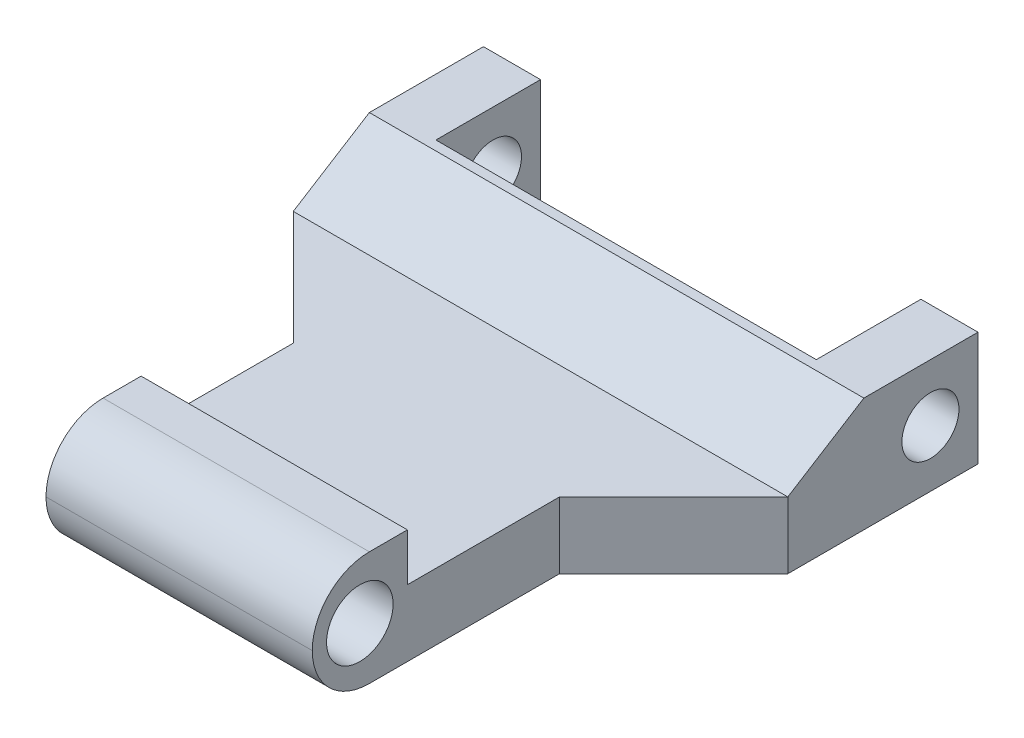
ISO-10303-21;
HEADER;
FILE_DESCRIPTION(('STEP AP214'),'2;1');
FILE_NAME('part.step','',(''),(''),'','','');
FILE_SCHEMA(('AUTOMOTIVE_DESIGN { 1 0 10303 214 1 1 1 1 }'));
ENDSEC;
DATA;
#1=APPLICATION_CONTEXT('core data for automotive mechanical design processes');
#2=APPLICATION_PROTOCOL_DEFINITION('international standard','automotive_design',2000,#1);
#3=PRODUCT_CONTEXT('',#1,'mechanical');
#4=PRODUCT('Part','Part','',(#3));
#5=PRODUCT_RELATED_PRODUCT_CATEGORY('part','',(#4));
#6=PRODUCT_DEFINITION_FORMATION('','',#4);
#7=PRODUCT_DEFINITION_CONTEXT('part definition',#1,'design');
#8=PRODUCT_DEFINITION('design','',#6,#7);
#9=PRODUCT_DEFINITION_SHAPE('','',#8);
#10=(LENGTH_UNIT() NAMED_UNIT(*) SI_UNIT(.MILLI.,.METRE.));
#11=(NAMED_UNIT(*) PLANE_ANGLE_UNIT() SI_UNIT($,.RADIAN.));
#12=(NAMED_UNIT(*) SI_UNIT($,.STERADIAN.) SOLID_ANGLE_UNIT());
#13=UNCERTAINTY_MEASURE_WITH_UNIT(LENGTH_MEASURE(1.E-05),#10,'distance_accuracy_value','');
#14=(GEOMETRIC_REPRESENTATION_CONTEXT(3) GLOBAL_UNCERTAINTY_ASSIGNED_CONTEXT((#13)) GLOBAL_UNIT_ASSIGNED_CONTEXT((#10,
#11,#12)) REPRESENTATION_CONTEXT('',''));
#15=CARTESIAN_POINT('',(0.,0.,0.));
#16=DIRECTION('',(0.,0.,1.));
#17=DIRECTION('',(1.,0.,0.));
#18=AXIS2_PLACEMENT_3D('',#15,#16,#17);
#19=CARTESIAN_POINT('',(-13.,6.,-18.7089552238806));
#20=DIRECTION('',(0.,0.,1.));
#21=DIRECTION('',(1.,0.,0.));
#22=AXIS2_PLACEMENT_3D('',#19,#20,#21);
#23=PLANE('',#22);
#24=DIRECTION('',(-1.,0.,0.));
#25=VECTOR('',#24,1.);
#26=CARTESIAN_POINT('',(-13.,0.,-18.7089552238806));
#27=LINE('',#26,#25);
#28=CARTESIAN_POINT('',(13.,0.,-18.7089552238806));
#29=VERTEX_POINT('',#28);
#30=CARTESIAN_POINT('',(10.,0.,-18.7089552238806));
#31=VERTEX_POINT('',#30);
#32=EDGE_CURVE('E170',#29,#31,#27,.T.);
#33=ORIENTED_EDGE('',*,*,#32,.T.);
#34=DIRECTION('',(0.,1.,0.));
#35=VECTOR('',#34,1.);
#36=CARTESIAN_POINT('',(10.,0.,-18.7089552238806));
#37=LINE('',#36,#35);
#38=CARTESIAN_POINT('',(10.,6.,-18.7089552238806));
#39=VERTEX_POINT('',#38);
#40=EDGE_CURVE('E220',#31,#39,#37,.T.);
#41=ORIENTED_EDGE('',*,*,#40,.T.);
#42=DIRECTION('',(-1.,0.,0.));
#43=VECTOR('',#42,1.);
#44=CARTESIAN_POINT('',(-13.,6.,-18.7089552238806));
#45=LINE('',#44,#43);
#46=CARTESIAN_POINT('',(13.,6.,-18.7089552238806));
#47=VERTEX_POINT('',#46);
#48=EDGE_CURVE('E271',#47,#39,#45,.T.);
#49=ORIENTED_EDGE('',*,*,#48,.F.);
#50=DIRECTION('',(0.,-1.,0.));
#51=VECTOR('',#50,1.);
#52=CARTESIAN_POINT('',(13.,6.,-18.7089552238806));
#53=LINE('',#52,#51);
#54=EDGE_CURVE('E190',#47,#29,#53,.T.);
#55=ORIENTED_EDGE('',*,*,#54,.T.);
#56=EDGE_LOOP('',(#33,#41,#49,#55));
#57=FACE_BOUND('',#56,.T.);
#58=ADVANCED_FACE('F32',(#57),#23,.F.);
#59=CARTESIAN_POINT('',(0.,6.,0.));
#60=DIRECTION('',(0.,-1.,0.));
#61=DIRECTION('',(0.,0.,-1.));
#62=AXIS2_PLACEMENT_3D('',#59,#60,#61);
#63=PLANE('',#62);
#64=DIRECTION('',(0.,0.,1.));
#65=VECTOR('',#64,1.);
#66=CARTESIAN_POINT('',(-7.,6.,10.2910447761194));
#67=LINE('',#66,#65);
#68=CARTESIAN_POINT('',(-7.,6.,5.2910447761194));
#69=VERTEX_POINT('',#68);
#70=CARTESIAN_POINT('',(-7.,6.,7.2910447761194));
#71=VERTEX_POINT('',#70);
#72=EDGE_CURVE('E182',#69,#71,#67,.T.);
#73=ORIENTED_EDGE('',*,*,#72,.T.);
#74=DIRECTION('',(1.,0.,0.));
#75=VECTOR('',#74,1.);
#76=CARTESIAN_POINT('',(0.,6.,7.2910447761194));
#77=LINE('',#76,#75);
#78=CARTESIAN_POINT('',(7.,6.,7.2910447761194));
#79=VERTEX_POINT('',#78);
#80=EDGE_CURVE('E11',#71,#79,#77,.T.);
#81=ORIENTED_EDGE('',*,*,#80,.T.);
#82=DIRECTION('',(0.,0.,-1.));
#83=VECTOR('',#82,1.);
#84=CARTESIAN_POINT('',(7.,6.,10.2910447761194));
#85=LINE('',#84,#83);
#86=CARTESIAN_POINT('',(7.,6.,5.2910447761194));
#87=VERTEX_POINT('',#86);
#88=EDGE_CURVE('E267',#79,#87,#85,.T.);
#89=ORIENTED_EDGE('',*,*,#88,.T.);
#90=DIRECTION('',(-1.,0.,0.));
#91=VECTOR('',#90,1.);
#92=CARTESIAN_POINT('',(0.,6.,5.2910447761194));
#93=LINE('',#92,#91);
#94=EDGE_CURVE('E198',#87,#69,#93,.T.);
#95=ORIENTED_EDGE('',*,*,#94,.T.);
#96=EDGE_LOOP('',(#73,#81,#89,#95));
#97=FACE_BOUND('',#96,.T.);
#98=ADVANCED_FACE('F320',(#97),#63,.F.);
#99=CARTESIAN_POINT('',(-7.,6.,10.2910447761194));
#100=DIRECTION('',(1.,0.,0.));
#101=DIRECTION('',(0.,0.,-1.));
#102=AXIS2_PLACEMENT_3D('',#99,#100,#101);
#103=PLANE('',#102);
#104=CARTESIAN_POINT('',(-7.,3.,7.79104477611941));
#105=DIRECTION('',(-1.,0.,0.));
#106=DIRECTION('',(0.,0.,1.));
#107=AXIS2_PLACEMENT_3D('',#104,#105,#106);
#108=CIRCLE('',#107,1.75);
#109=CARTESIAN_POINT('',(-7.,3.,9.5410447761194));
#110=VERTEX_POINT('',#109);
#111=EDGE_CURVE('E209',#110,#110,#108,.T.);
#112=ORIENTED_EDGE('',*,*,#111,.F.);
#113=EDGE_LOOP('',(#112));
#114=FACE_BOUND('',#113,.T.);
#115=DIRECTION('',(0.,0.,1.));
#116=VECTOR('',#115,1.);
#117=CARTESIAN_POINT('',(-7.,0.,10.2910447761194));
#118=LINE('',#117,#116);
#119=CARTESIAN_POINT('',(-7.,0.,-2.7089552238806));
#120=VERTEX_POINT('',#119);
#121=CARTESIAN_POINT('',(-7.,0.,7.2910447761194));
#122=VERTEX_POINT('',#121);
#123=EDGE_CURVE('E264',#120,#122,#118,.T.);
#124=ORIENTED_EDGE('',*,*,#123,.T.);
#125=CARTESIAN_POINT('',(-7.,3.,7.2910447761194));
#126=DIRECTION('',(1.,0.,0.));
#127=DIRECTION('',(0.,0.,-1.));
#128=AXIS2_PLACEMENT_3D('',#125,#126,#127);
#129=CIRCLE('',#128,3.);
#130=CARTESIAN_POINT('',(-7.,3.,10.2910447761194));
#131=VERTEX_POINT('',#130);
#132=EDGE_CURVE('E41',#122,#131,#129,.F.);
#133=ORIENTED_EDGE('',*,*,#132,.T.);
#134=CARTESIAN_POINT('',(-7.,3.,7.2910447761194));
#135=DIRECTION('',(1.,0.,0.));
#136=DIRECTION('',(0.,0.,-1.));
#137=AXIS2_PLACEMENT_3D('',#134,#135,#136);
#138=CIRCLE('',#137,3.);
#139=EDGE_CURVE('E216',#131,#71,#138,.F.);
#140=ORIENTED_EDGE('',*,*,#139,.T.);
#141=ORIENTED_EDGE('',*,*,#72,.F.);
#142=DIRECTION('',(0.,-1.,0.));
#143=VECTOR('',#142,1.);
#144=CARTESIAN_POINT('',(-7.,6.,5.2910447761194));
#145=LINE('',#144,#143);
#146=CARTESIAN_POINT('',(-7.,3.5,5.2910447761194));
#147=VERTEX_POINT('',#146);
#148=EDGE_CURVE('E252',#69,#147,#145,.T.);
#149=ORIENTED_EDGE('',*,*,#148,.T.);
#150=DIRECTION('',(0.,0.,-1.));
#151=VECTOR('',#150,1.);
#152=CARTESIAN_POINT('',(-7.,3.5,10.2910447761194));
#153=LINE('',#152,#151);
#154=CARTESIAN_POINT('',(-7.,3.5,-2.7089552238806));
#155=VERTEX_POINT('',#154);
#156=EDGE_CURVE('E255',#147,#155,#153,.T.);
#157=ORIENTED_EDGE('',*,*,#156,.T.);
#158=DIRECTION('',(0.,-1.,0.));
#159=VECTOR('',#158,1.);
#160=CARTESIAN_POINT('',(-7.,6.,-2.7089552238806));
#161=LINE('',#160,#159);
#162=EDGE_CURVE('E183',#155,#120,#161,.T.);
#163=ORIENTED_EDGE('',*,*,#162,.T.);
#164=EDGE_LOOP('',(#124,#133,#140,#141,#149,#157,#163));
#165=FACE_BOUND('',#164,.T.);
#166=ADVANCED_FACE('F325',(#114,#165),#103,.F.);
#167=CARTESIAN_POINT('',(7.,6.,10.2910447761194));
#168=DIRECTION('',(-1.,0.,0.));
#169=DIRECTION('',(0.,0.,1.));
#170=AXIS2_PLACEMENT_3D('',#167,#168,#169);
#171=PLANE('',#170);
#172=CARTESIAN_POINT('',(7.,3.,7.79104477611941));
#173=DIRECTION('',(-1.,0.,0.));
#174=DIRECTION('',(0.,0.,1.));
#175=AXIS2_PLACEMENT_3D('',#172,#173,#174);
#176=CIRCLE('',#175,1.75);
#177=CARTESIAN_POINT('',(7.,3.,9.5410447761194));
#178=VERTEX_POINT('',#177);
#179=EDGE_CURVE('E205',#178,#178,#176,.T.);
#180=ORIENTED_EDGE('',*,*,#179,.T.);
#181=EDGE_LOOP('',(#180));
#182=FACE_BOUND('',#181,.T.);
#183=CARTESIAN_POINT('',(7.,3.,7.2910447761194));
#184=DIRECTION('',(-1.,0.,0.));
#185=DIRECTION('',(0.,0.,1.));
#186=AXIS2_PLACEMENT_3D('',#183,#184,#185);
#187=CIRCLE('',#186,3.);
#188=CARTESIAN_POINT('',(7.,3.,10.2910447761194));
#189=VERTEX_POINT('',#188);
#190=EDGE_CURVE('E204',#79,#189,#187,.F.);
#191=ORIENTED_EDGE('',*,*,#190,.T.);
#192=CARTESIAN_POINT('',(7.,3.,7.2910447761194));
#193=DIRECTION('',(-1.,0.,0.));
#194=DIRECTION('',(0.,0.,1.));
#195=AXIS2_PLACEMENT_3D('',#192,#193,#194);
#196=CIRCLE('',#195,3.);
#197=CARTESIAN_POINT('',(7.,0.,7.2910447761194));
#198=VERTEX_POINT('',#197);
#199=EDGE_CURVE('E211',#189,#198,#196,.F.);
#200=ORIENTED_EDGE('',*,*,#199,.T.);
#201=DIRECTION('',(0.,0.,-1.));
#202=VECTOR('',#201,1.);
#203=CARTESIAN_POINT('',(7.,0.,10.2910447761194));
#204=LINE('',#203,#202);
#205=CARTESIAN_POINT('',(7.,0.,-2.7089552238806));
#206=VERTEX_POINT('',#205);
#207=EDGE_CURVE('E276',#198,#206,#204,.T.);
#208=ORIENTED_EDGE('',*,*,#207,.T.);
#209=DIRECTION('',(0.,-1.,0.));
#210=VECTOR('',#209,1.);
#211=CARTESIAN_POINT('',(7.,6.,-2.7089552238806));
#212=LINE('',#211,#210);
#213=CARTESIAN_POINT('',(7.,3.5,-2.7089552238806));
#214=VERTEX_POINT('',#213);
#215=EDGE_CURVE('E195',#214,#206,#212,.T.);
#216=ORIENTED_EDGE('',*,*,#215,.F.);
#217=DIRECTION('',(0.,0.,1.));
#218=VECTOR('',#217,1.);
#219=CARTESIAN_POINT('',(7.,3.5,10.2910447761194));
#220=LINE('',#219,#218);
#221=CARTESIAN_POINT('',(7.,3.5,5.2910447761194));
#222=VERTEX_POINT('',#221);
#223=EDGE_CURVE('E261',#214,#222,#220,.T.);
#224=ORIENTED_EDGE('',*,*,#223,.T.);
#225=DIRECTION('',(0.,1.,0.));
#226=VECTOR('',#225,1.);
#227=CARTESIAN_POINT('',(7.,6.,5.2910447761194));
#228=LINE('',#227,#226);
#229=EDGE_CURVE('E246',#222,#87,#228,.T.);
#230=ORIENTED_EDGE('',*,*,#229,.T.);
#231=ORIENTED_EDGE('',*,*,#88,.F.);
#232=EDGE_LOOP('',(#191,#200,#208,#216,#224,#230,#231));
#233=FACE_BOUND('',#232,.T.);
#234=ADVANCED_FACE('F303',(#182,#233),#171,.F.);
#235=CARTESIAN_POINT('',(7.,6.,-2.7089552238806));
#236=DIRECTION('',(-0.707106781186548,0.,-0.707106781186547));
#237=DIRECTION('',(-0.707106781186547,0.,0.707106781186548));
#238=AXIS2_PLACEMENT_3D('',#235,#236,#237);
#239=PLANE('',#238);
#240=DIRECTION('',(0.,-1.,0.));
#241=VECTOR('',#240,1.);
#242=CARTESIAN_POINT('',(13.,6.,-8.7089552238806));
#243=LINE('',#242,#241);
#244=CARTESIAN_POINT('',(13.,3.5,-8.7089552238806));
#245=VERTEX_POINT('',#244);
#246=CARTESIAN_POINT('',(13.,0.,-8.7089552238806));
#247=VERTEX_POINT('',#246);
#248=EDGE_CURVE('E193',#245,#247,#243,.T.);
#249=ORIENTED_EDGE('',*,*,#248,.F.);
#250=DIRECTION('',(-0.707106781186547,0.,0.707106781186548));
#251=VECTOR('',#250,1.);
#252=CARTESIAN_POINT('',(7.,3.5,-2.7089552238806));
#253=LINE('',#252,#251);
#254=EDGE_CURVE('E258',#245,#214,#253,.T.);
#255=ORIENTED_EDGE('',*,*,#254,.T.);
#256=ORIENTED_EDGE('',*,*,#215,.T.);
#257=DIRECTION('',(0.707106781186547,0.,-0.707106781186548));
#258=VECTOR('',#257,1.);
#259=CARTESIAN_POINT('',(7.,0.,-2.7089552238806));
#260=LINE('',#259,#258);
#261=EDGE_CURVE('E174',#206,#247,#260,.T.);
#262=ORIENTED_EDGE('',*,*,#261,.T.);
#263=EDGE_LOOP('',(#249,#255,#256,#262));
#264=FACE_BOUND('',#263,.T.);
#265=ADVANCED_FACE('F282',(#264),#239,.F.);
#266=CARTESIAN_POINT('',(13.,6.,-8.7089552238806));
#267=DIRECTION('',(-1.,0.,0.));
#268=DIRECTION('',(0.,0.,1.));
#269=AXIS2_PLACEMENT_3D('',#266,#267,#268);
#270=PLANE('',#269);
#271=CARTESIAN_POINT('',(13.,3.,-16.2089552238806));
#272=DIRECTION('',(-1.,0.,0.));
#273=DIRECTION('',(0.,0.,1.));
#274=AXIS2_PLACEMENT_3D('',#271,#272,#273);
#275=CIRCLE('',#274,1.5);
#276=CARTESIAN_POINT('',(13.,3.,-14.7089552238806));
#277=VERTEX_POINT('',#276);
#278=EDGE_CURVE('E370',#277,#277,#275,.T.);
#279=ORIENTED_EDGE('',*,*,#278,.T.);
#280=EDGE_LOOP('',(#279));
#281=FACE_BOUND('',#280,.T.);
#282=DIRECTION('',(0.,0.,-1.));
#283=VECTOR('',#282,1.);
#284=CARTESIAN_POINT('',(13.,6.,-8.7089552238806));
#285=LINE('',#284,#283);
#286=CARTESIAN_POINT('',(13.,6.,-12.7089552238806));
#287=VERTEX_POINT('',#286);
#288=EDGE_CURVE('E269',#287,#47,#285,.T.);
#289=ORIENTED_EDGE('',*,*,#288,.F.);
#290=DIRECTION('',(0.,-0.52999894000318,0.847998304005088));
#291=VECTOR('',#290,1.);
#292=CARTESIAN_POINT('',(13.,6.,-12.7089552238806));
#293=LINE('',#292,#291);
#294=EDGE_CURVE('E237',#287,#245,#293,.T.);
#295=ORIENTED_EDGE('',*,*,#294,.T.);
#296=ORIENTED_EDGE('',*,*,#248,.T.);
#297=DIRECTION('',(0.,0.,-1.));
#298=VECTOR('',#297,1.);
#299=CARTESIAN_POINT('',(13.,0.,-8.7089552238806));
#300=LINE('',#299,#298);
#301=EDGE_CURVE('E171',#247,#29,#300,.T.);
#302=ORIENTED_EDGE('',*,*,#301,.T.);
#303=ORIENTED_EDGE('',*,*,#54,.F.);
#304=EDGE_LOOP('',(#289,#295,#296,#302,#303));
#305=FACE_BOUND('',#304,.T.);
#306=ADVANCED_FACE('F289',(#281,#305),#270,.F.);
#307=CARTESIAN_POINT('',(-10.,6.,-18.7089552238806));
#308=VERTEX_POINT('',#307);
#309=CARTESIAN_POINT('',(-13.,6.,-18.7089552238806));
#310=VERTEX_POINT('',#309);
#311=EDGE_CURVE('E161',#308,#310,#45,.T.);
#312=ORIENTED_EDGE('',*,*,#311,.F.);
#313=DIRECTION('',(0.,1.,0.));
#314=VECTOR('',#313,1.);
#315=CARTESIAN_POINT('',(-10.,0.,-18.7089552238806));
#316=LINE('',#315,#314);
#317=CARTESIAN_POINT('',(-10.,0.,-18.7089552238806));
#318=VERTEX_POINT('',#317);
#319=EDGE_CURVE('E148',#318,#308,#316,.T.);
#320=ORIENTED_EDGE('',*,*,#319,.F.);
#321=CARTESIAN_POINT('',(-13.,0.,-18.7089552238806));
#322=VERTEX_POINT('',#321);
#323=EDGE_CURVE('E159',#318,#322,#27,.T.);
#324=ORIENTED_EDGE('',*,*,#323,.T.);
#325=DIRECTION('',(0.,-1.,0.));
#326=VECTOR('',#325,1.);
#327=CARTESIAN_POINT('',(-13.,6.,-18.7089552238806));
#328=LINE('',#327,#326);
#329=EDGE_CURVE('E188',#310,#322,#328,.T.);
#330=ORIENTED_EDGE('',*,*,#329,.F.);
#331=EDGE_LOOP('',(#312,#320,#324,#330));
#332=FACE_BOUND('',#331,.T.);
#333=ADVANCED_FACE('F157',(#332),#23,.F.);
#334=CARTESIAN_POINT('',(-13.,6.,-8.7089552238806));
#335=DIRECTION('',(1.,0.,0.));
#336=DIRECTION('',(0.,0.,-1.));
#337=AXIS2_PLACEMENT_3D('',#334,#335,#336);
#338=PLANE('',#337);
#339=CARTESIAN_POINT('',(-13.,3.,-16.2089552238806));
#340=DIRECTION('',(-1.,0.,0.));
#341=DIRECTION('',(0.,0.,1.));
#342=AXIS2_PLACEMENT_3D('',#339,#340,#341);
#343=CIRCLE('',#342,1.5);
#344=CARTESIAN_POINT('',(-13.,3.,-14.7089552238806));
#345=VERTEX_POINT('',#344);
#346=EDGE_CURVE('E367',#345,#345,#343,.T.);
#347=ORIENTED_EDGE('',*,*,#346,.F.);
#348=EDGE_LOOP('',(#347));
#349=FACE_BOUND('',#348,.T.);
#350=DIRECTION('',(0.,-1.,0.));
#351=VECTOR('',#350,1.);
#352=CARTESIAN_POINT('',(-13.,6.,-8.7089552238806));
#353=LINE('',#352,#351);
#354=CARTESIAN_POINT('',(-13.,3.5,-8.7089552238806));
#355=VERTEX_POINT('',#354);
#356=CARTESIAN_POINT('',(-13.,0.,-8.7089552238806));
#357=VERTEX_POINT('',#356);
#358=EDGE_CURVE('E185',#355,#357,#353,.T.);
#359=ORIENTED_EDGE('',*,*,#358,.F.);
#360=DIRECTION('',(0.,-0.52999894000318,0.847998304005088));
#361=VECTOR('',#360,1.);
#362=CARTESIAN_POINT('',(-13.,6.,-12.7089552238806));
#363=LINE('',#362,#361);
#364=CARTESIAN_POINT('',(-13.,6.,-12.7089552238806));
#365=VERTEX_POINT('',#364);
#366=EDGE_CURVE('E208',#365,#355,#363,.T.);
#367=ORIENTED_EDGE('',*,*,#366,.F.);
#368=DIRECTION('',(0.,0.,1.));
#369=VECTOR('',#368,1.);
#370=CARTESIAN_POINT('',(-13.,6.,-8.7089552238806));
#371=LINE('',#370,#369);
#372=EDGE_CURVE('E186',#310,#365,#371,.T.);
#373=ORIENTED_EDGE('',*,*,#372,.F.);
#374=ORIENTED_EDGE('',*,*,#329,.T.);
#375=DIRECTION('',(0.,0.,1.));
#376=VECTOR('',#375,1.);
#377=CARTESIAN_POINT('',(-13.,0.,-8.7089552238806));
#378=LINE('',#377,#376);
#379=EDGE_CURVE('E169',#322,#357,#378,.T.);
#380=ORIENTED_EDGE('',*,*,#379,.T.);
#381=EDGE_LOOP('',(#359,#367,#373,#374,#380));
#382=FACE_BOUND('',#381,.T.);
#383=ADVANCED_FACE('F331',(#349,#382),#338,.F.);
#384=CARTESIAN_POINT('',(-7.,6.,-2.7089552238806));
#385=DIRECTION('',(0.707106781186548,0.,-0.707106781186547));
#386=DIRECTION('',(-0.707106781186547,0.,-0.707106781186548));
#387=AXIS2_PLACEMENT_3D('',#384,#385,#386);
#388=PLANE('',#387);
#389=ORIENTED_EDGE('',*,*,#162,.F.);
#390=DIRECTION('',(-0.707106781186547,0.,-0.707106781186548));
#391=VECTOR('',#390,1.);
#392=CARTESIAN_POINT('',(-7.,3.5,-2.7089552238806));
#393=LINE('',#392,#391);
#394=EDGE_CURVE('E201',#155,#355,#393,.T.);
#395=ORIENTED_EDGE('',*,*,#394,.T.);
#396=ORIENTED_EDGE('',*,*,#358,.T.);
#397=DIRECTION('',(0.707106781186547,0.,0.707106781186548));
#398=VECTOR('',#397,1.);
#399=CARTESIAN_POINT('',(-7.,0.,-2.7089552238806));
#400=LINE('',#399,#398);
#401=EDGE_CURVE('E179',#357,#120,#400,.T.);
#402=ORIENTED_EDGE('',*,*,#401,.T.);
#403=EDGE_LOOP('',(#389,#395,#396,#402));
#404=FACE_BOUND('',#403,.T.);
#405=ADVANCED_FACE('F336',(#404),#388,.F.);
#406=ORIENTED_EDGE('',*,*,#48,.T.);
#407=DIRECTION('',(0.,0.,-1.));
#408=VECTOR('',#407,1.);
#409=CARTESIAN_POINT('',(10.,6.,-18.7089552238806));
#410=LINE('',#409,#408);
#411=CARTESIAN_POINT('',(10.,6.,-13.2089552238806));
#412=VERTEX_POINT('',#411);
#413=EDGE_CURVE('E153',#412,#39,#410,.T.);
#414=ORIENTED_EDGE('',*,*,#413,.F.);
#415=DIRECTION('',(1.,0.,0.));
#416=VECTOR('',#415,1.);
#417=CARTESIAN_POINT('',(-10.,6.,-13.2089552238806));
#418=LINE('',#417,#416);
#419=CARTESIAN_POINT('',(-10.,6.,-13.2089552238806));
#420=VERTEX_POINT('',#419);
#421=EDGE_CURVE('E359',#420,#412,#418,.T.);
#422=ORIENTED_EDGE('',*,*,#421,.F.);
#423=DIRECTION('',(0.,0.,1.));
#424=VECTOR('',#423,1.);
#425=CARTESIAN_POINT('',(-10.,6.,-18.7089552238806));
#426=LINE('',#425,#424);
#427=EDGE_CURVE('E357',#308,#420,#426,.T.);
#428=ORIENTED_EDGE('',*,*,#427,.F.);
#429=ORIENTED_EDGE('',*,*,#311,.T.);
#430=ORIENTED_EDGE('',*,*,#372,.T.);
#431=DIRECTION('',(-1.,0.,0.));
#432=VECTOR('',#431,1.);
#433=CARTESIAN_POINT('',(13.,6.,-12.7089552238806));
#434=LINE('',#433,#432);
#435=EDGE_CURVE('E240',#287,#365,#434,.T.);
#436=ORIENTED_EDGE('',*,*,#435,.F.);
#437=ORIENTED_EDGE('',*,*,#288,.T.);
#438=EDGE_LOOP('',(#406,#414,#422,#428,#429,#430,#436,#437));
#439=FACE_BOUND('',#438,.T.);
#440=ADVANCED_FACE('F292',(#439),#63,.F.);
#441=CARTESIAN_POINT('',(0.,0.,0.));
#442=DIRECTION('',(0.,-1.,0.));
#443=DIRECTION('',(0.,0.,-1.));
#444=AXIS2_PLACEMENT_3D('',#441,#442,#443);
#445=PLANE('',#444);
#446=DIRECTION('',(0.,0.,-1.));
#447=VECTOR('',#446,1.);
#448=CARTESIAN_POINT('',(10.,0.,-18.7089552238806));
#449=LINE('',#448,#447);
#450=CARTESIAN_POINT('',(10.,0.,-13.2089552238806));
#451=VERTEX_POINT('',#450);
#452=EDGE_CURVE('E162',#451,#31,#449,.T.);
#453=ORIENTED_EDGE('',*,*,#452,.T.);
#454=ORIENTED_EDGE('',*,*,#32,.F.);
#455=ORIENTED_EDGE('',*,*,#301,.F.);
#456=ORIENTED_EDGE('',*,*,#261,.F.);
#457=ORIENTED_EDGE('',*,*,#207,.F.);
#458=DIRECTION('',(1.,0.,0.));
#459=VECTOR('',#458,1.);
#460=CARTESIAN_POINT('',(-7.,0.,7.2910447761194));
#461=LINE('',#460,#459);
#462=EDGE_CURVE('E213',#198,#122,#461,.F.);
#463=ORIENTED_EDGE('',*,*,#462,.T.);
#464=ORIENTED_EDGE('',*,*,#123,.F.);
#465=ORIENTED_EDGE('',*,*,#401,.F.);
#466=ORIENTED_EDGE('',*,*,#379,.F.);
#467=ORIENTED_EDGE('',*,*,#323,.F.);
#468=DIRECTION('',(0.,0.,1.));
#469=VECTOR('',#468,1.);
#470=CARTESIAN_POINT('',(-10.,0.,-18.7089552238806));
#471=LINE('',#470,#469);
#472=CARTESIAN_POINT('',(-10.,0.,-13.2089552238806));
#473=VERTEX_POINT('',#472);
#474=EDGE_CURVE('E144',#318,#473,#471,.T.);
#475=ORIENTED_EDGE('',*,*,#474,.T.);
#476=DIRECTION('',(1.,0.,0.));
#477=VECTOR('',#476,1.);
#478=CARTESIAN_POINT('',(-10.,0.,-13.2089552238806));
#479=LINE('',#478,#477);
#480=EDGE_CURVE('E49',#473,#451,#479,.T.);
#481=ORIENTED_EDGE('',*,*,#480,.T.);
#482=EDGE_LOOP('',(#453,#454,#455,#456,#457,#463,#464,#465,#466,#467,#475,#481));
#483=FACE_BOUND('',#482,.T.);
#484=ADVANCED_FACE('F166',(#483),#445,.T.);
#485=CARTESIAN_POINT('',(13.,3.5,-8.7089552238806));
#486=DIRECTION('',(0.,-1.,0.));
#487=DIRECTION('',(0.,0.,-1.));
#488=AXIS2_PLACEMENT_3D('',#485,#486,#487);
#489=PLANE('',#488);
#490=ORIENTED_EDGE('',*,*,#254,.F.);
#491=DIRECTION('',(-1.,0.,0.));
#492=VECTOR('',#491,1.);
#493=CARTESIAN_POINT('',(13.,3.5,-8.7089552238806));
#494=LINE('',#493,#492);
#495=EDGE_CURVE('E247',#245,#355,#494,.T.);
#496=ORIENTED_EDGE('',*,*,#495,.T.);
#497=ORIENTED_EDGE('',*,*,#394,.F.);
#498=ORIENTED_EDGE('',*,*,#156,.F.);
#499=DIRECTION('',(-1.,0.,0.));
#500=VECTOR('',#499,1.);
#501=CARTESIAN_POINT('',(13.,3.5,5.2910447761194));
#502=LINE('',#501,#500);
#503=EDGE_CURVE('E243',#222,#147,#502,.T.);
#504=ORIENTED_EDGE('',*,*,#503,.F.);
#505=ORIENTED_EDGE('',*,*,#223,.F.);
#506=EDGE_LOOP('',(#490,#496,#497,#498,#504,#505));
#507=FACE_BOUND('',#506,.T.);
#508=ADVANCED_FACE('F300',(#507),#489,.F.);
#509=CARTESIAN_POINT('',(13.,13.3088935287444,5.2910447761194));
#510=DIRECTION('',(0.,0.,1.));
#511=DIRECTION('',(0.,-1.,0.));
#512=AXIS2_PLACEMENT_3D('',#509,#510,#511);
#513=PLANE('',#512);
#514=ORIENTED_EDGE('',*,*,#94,.F.);
#515=ORIENTED_EDGE('',*,*,#229,.F.);
#516=ORIENTED_EDGE('',*,*,#503,.T.);
#517=ORIENTED_EDGE('',*,*,#148,.F.);
#518=EDGE_LOOP('',(#514,#515,#516,#517));
#519=FACE_BOUND('',#518,.T.);
#520=ADVANCED_FACE('F395',(#519),#513,.F.);
#521=CARTESIAN_POINT('',(13.,6.,-12.7089552238806));
#522=DIRECTION('',(0.,-0.847998304005088,-0.52999894000318));
#523=DIRECTION('',(0.,0.52999894000318,-0.847998304005088));
#524=AXIS2_PLACEMENT_3D('',#521,#522,#523);
#525=PLANE('',#524);
#526=ORIENTED_EDGE('',*,*,#366,.T.);
#527=ORIENTED_EDGE('',*,*,#495,.F.);
#528=ORIENTED_EDGE('',*,*,#294,.F.);
#529=ORIENTED_EDGE('',*,*,#435,.T.);
#530=EDGE_LOOP('',(#526,#527,#528,#529));
#531=FACE_BOUND('',#530,.T.);
#532=ADVANCED_FACE('F297',(#531),#525,.F.);
#533=CARTESIAN_POINT('',(13.,3.,7.79104477611941));
#534=DIRECTION('',(-1.,0.,0.));
#535=DIRECTION('',(0.,0.,1.));
#536=AXIS2_PLACEMENT_3D('',#533,#534,#535);
#537=CYLINDRICAL_SURFACE('',#536,1.75);
#538=ORIENTED_EDGE('',*,*,#111,.T.);
#539=EDGE_LOOP('',(#538));
#540=FACE_BOUND('',#539,.T.);
#541=ORIENTED_EDGE('',*,*,#179,.F.);
#542=EDGE_LOOP('',(#541));
#543=FACE_BOUND('',#542,.T.);
#544=ADVANCED_FACE('F316',(#540,#543),#537,.F.);
#545=CARTESIAN_POINT('',(0.,3.,7.2910447761194));
#546=DIRECTION('',(1.,0.,0.));
#547=DIRECTION('',(0.,0.,-1.));
#548=AXIS2_PLACEMENT_3D('',#545,#546,#547);
#549=CYLINDRICAL_SURFACE('',#548,3.);
#550=ORIENTED_EDGE('',*,*,#80,.F.);
#551=ORIENTED_EDGE('',*,*,#139,.F.);
#552=DIRECTION('',(1.,0.,0.));
#553=VECTOR('',#552,1.);
#554=CARTESIAN_POINT('',(7.,3.,10.2910447761194));
#555=LINE('',#554,#553);
#556=EDGE_CURVE('E218',#189,#131,#555,.F.);
#557=ORIENTED_EDGE('',*,*,#556,.F.);
#558=ORIENTED_EDGE('',*,*,#190,.F.);
#559=EDGE_LOOP('',(#550,#551,#557,#558));
#560=FACE_BOUND('',#559,.T.);
#561=ADVANCED_FACE('F34',(#560),#549,.T.);
#562=CARTESIAN_POINT('',(7.,3.,7.2910447761194));
#563=DIRECTION('',(-1.,0.,0.));
#564=DIRECTION('',(0.,0.,1.));
#565=AXIS2_PLACEMENT_3D('',#562,#563,#564);
#566=CYLINDRICAL_SURFACE('',#565,3.);
#567=ORIENTED_EDGE('',*,*,#132,.F.);
#568=ORIENTED_EDGE('',*,*,#462,.F.);
#569=ORIENTED_EDGE('',*,*,#199,.F.);
#570=ORIENTED_EDGE('',*,*,#556,.T.);
#571=EDGE_LOOP('',(#567,#568,#569,#570));
#572=FACE_BOUND('',#571,.T.);
#573=ADVANCED_FACE('F306',(#572),#566,.T.);
#574=CARTESIAN_POINT('',(10.,0.,-18.7089552238806));
#575=DIRECTION('',(1.,0.,0.));
#576=DIRECTION('',(0.,0.,-1.));
#577=AXIS2_PLACEMENT_3D('',#574,#575,#576);
#578=PLANE('',#577);
#579=CARTESIAN_POINT('',(10.,3.,-16.2089552238806));
#580=DIRECTION('',(1.,0.,0.));
#581=DIRECTION('',(0.,0.,-1.));
#582=AXIS2_PLACEMENT_3D('',#579,#580,#581);
#583=CIRCLE('',#582,1.5);
#584=CARTESIAN_POINT('',(10.,3.,-17.7089552238806));
#585=VERTEX_POINT('',#584);
#586=EDGE_CURVE('E360',#585,#585,#583,.T.);
#587=ORIENTED_EDGE('',*,*,#586,.T.);
#588=EDGE_LOOP('',(#587));
#589=FACE_BOUND('',#588,.T.);
#590=ORIENTED_EDGE('',*,*,#413,.T.);
#591=ORIENTED_EDGE('',*,*,#40,.F.);
#592=ORIENTED_EDGE('',*,*,#452,.F.);
#593=DIRECTION('',(0.,1.,0.));
#594=VECTOR('',#593,1.);
#595=CARTESIAN_POINT('',(10.,0.,-13.2089552238806));
#596=LINE('',#595,#594);
#597=EDGE_CURVE('E227',#451,#412,#596,.T.);
#598=ORIENTED_EDGE('',*,*,#597,.T.);
#599=EDGE_LOOP('',(#590,#591,#592,#598));
#600=FACE_BOUND('',#599,.T.);
#601=ADVANCED_FACE('F308',(#589,#600),#578,.F.);
#602=CARTESIAN_POINT('',(-10.,0.,-13.2089552238806));
#603=DIRECTION('',(0.,0.,1.));
#604=DIRECTION('',(1.,0.,0.));
#605=AXIS2_PLACEMENT_3D('',#602,#603,#604);
#606=PLANE('',#605);
#607=ORIENTED_EDGE('',*,*,#421,.T.);
#608=ORIENTED_EDGE('',*,*,#597,.F.);
#609=ORIENTED_EDGE('',*,*,#480,.F.);
#610=DIRECTION('',(0.,1.,0.));
#611=VECTOR('',#610,1.);
#612=CARTESIAN_POINT('',(-10.,0.,-13.2089552238806));
#613=LINE('',#612,#611);
#614=EDGE_CURVE('E150',#473,#420,#613,.T.);
#615=ORIENTED_EDGE('',*,*,#614,.T.);
#616=EDGE_LOOP('',(#607,#608,#609,#615));
#617=FACE_BOUND('',#616,.T.);
#618=ADVANCED_FACE('F313',(#617),#606,.F.);
#619=CARTESIAN_POINT('',(-10.,0.,-18.7089552238806));
#620=DIRECTION('',(-1.,0.,0.));
#621=DIRECTION('',(0.,0.,1.));
#622=AXIS2_PLACEMENT_3D('',#619,#620,#621);
#623=PLANE('',#622);
#624=CARTESIAN_POINT('',(-10.,3.,-16.2089552238806));
#625=DIRECTION('',(-1.,0.,0.));
#626=DIRECTION('',(0.,0.,1.));
#627=AXIS2_PLACEMENT_3D('',#624,#625,#626);
#628=CIRCLE('',#627,1.5);
#629=CARTESIAN_POINT('',(-10.,3.,-14.7089552238806));
#630=VERTEX_POINT('',#629);
#631=EDGE_CURVE('E36',#630,#630,#628,.T.);
#632=ORIENTED_EDGE('',*,*,#631,.T.);
#633=EDGE_LOOP('',(#632));
#634=FACE_BOUND('',#633,.T.);
#635=ORIENTED_EDGE('',*,*,#427,.T.);
#636=ORIENTED_EDGE('',*,*,#614,.F.);
#637=ORIENTED_EDGE('',*,*,#474,.F.);
#638=ORIENTED_EDGE('',*,*,#319,.T.);
#639=EDGE_LOOP('',(#635,#636,#637,#638));
#640=FACE_BOUND('',#639,.T.);
#641=ADVANCED_FACE('F147',(#634,#640),#623,.F.);
#642=CARTESIAN_POINT('',(13.,3.,-16.2089552238806));
#643=DIRECTION('',(-1.,0.,0.));
#644=DIRECTION('',(0.,0.,1.));
#645=AXIS2_PLACEMENT_3D('',#642,#643,#644);
#646=CYLINDRICAL_SURFACE('',#645,1.5);
#647=ORIENTED_EDGE('',*,*,#346,.T.);
#648=EDGE_LOOP('',(#647));
#649=FACE_BOUND('',#648,.T.);
#650=ORIENTED_EDGE('',*,*,#631,.F.);
#651=EDGE_LOOP('',(#650));
#652=FACE_BOUND('',#651,.T.);
#653=ADVANCED_FACE('F376',(#649,#652),#646,.F.);
#654=ORIENTED_EDGE('',*,*,#278,.F.);
#655=EDGE_LOOP('',(#654));
#656=FACE_BOUND('',#655,.T.);
#657=ORIENTED_EDGE('',*,*,#586,.F.);
#658=EDGE_LOOP('',(#657));
#659=FACE_BOUND('',#658,.T.);
#660=ADVANCED_FACE('F378',(#656,#659),#646,.F.);
#661=CLOSED_SHELL('',(#58,#98,#166,#234,#265,#306,#333,#383,#405,#440,#484,#508,#520,#532,#544,
#561,#573,#601,#618,#641,#653,#660));
#662=MANIFOLD_SOLID_BREP('B2',#661);
#663=ADVANCED_BREP_SHAPE_REPRESENTATION('',(#18,#662),#14);
#664=SHAPE_DEFINITION_REPRESENTATION(#9,#663);
ENDSEC;
END-ISO-10303-21;
